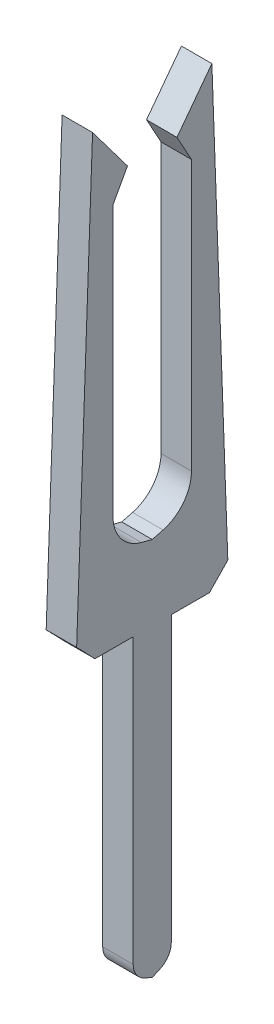
ISO-10303-21;
HEADER;
FILE_DESCRIPTION(('STEP AP214'),'2;1');
FILE_NAME('part.step','',(''),(''),'','','');
FILE_SCHEMA(('AUTOMOTIVE_DESIGN { 1 0 10303 214 1 1 1 1 }'));
ENDSEC;
DATA;
#1=APPLICATION_CONTEXT('core data for automotive mechanical design processes');
#2=APPLICATION_PROTOCOL_DEFINITION('international standard','automotive_design',2000,#1);
#3=PRODUCT_CONTEXT('',#1,'mechanical');
#4=PRODUCT('Part','Part','',(#3));
#5=PRODUCT_RELATED_PRODUCT_CATEGORY('part','',(#4));
#6=PRODUCT_DEFINITION_FORMATION('','',#4);
#7=PRODUCT_DEFINITION_CONTEXT('part definition',#1,'design');
#8=PRODUCT_DEFINITION('design','',#6,#7);
#9=PRODUCT_DEFINITION_SHAPE('','',#8);
#10=(LENGTH_UNIT() NAMED_UNIT(*) SI_UNIT(.MILLI.,.METRE.));
#11=(NAMED_UNIT(*) PLANE_ANGLE_UNIT() SI_UNIT($,.RADIAN.));
#12=(NAMED_UNIT(*) SI_UNIT($,.STERADIAN.) SOLID_ANGLE_UNIT());
#13=UNCERTAINTY_MEASURE_WITH_UNIT(LENGTH_MEASURE(1.E-05),#10,'distance_accuracy_value','');
#14=(GEOMETRIC_REPRESENTATION_CONTEXT(3) GLOBAL_UNCERTAINTY_ASSIGNED_CONTEXT((#13)) GLOBAL_UNIT_ASSIGNED_CONTEXT((#10,
#11,#12)) REPRESENTATION_CONTEXT('',''));
#15=CARTESIAN_POINT('',(0.,0.,0.));
#16=DIRECTION('',(0.,0.,1.));
#17=DIRECTION('',(1.,0.,0.));
#18=AXIS2_PLACEMENT_3D('',#15,#16,#17);
#19=CARTESIAN_POINT('',(0.4,2.15627423693323,0.277438328452502));
#20=DIRECTION('',(0.,0.694137309805425,0.71984261831048));
#21=DIRECTION('',(0.,-0.71984261831048,0.694137309805425));
#22=AXIS2_PLACEMENT_3D('',#19,#20,#21);
#23=PLANE('',#22);
#24=DIRECTION('',(0.,0.71984261831048,-0.694137309805425));
#25=VECTOR('',#24,1.);
#26=CARTESIAN_POINT('',(0.,2.15627423693323,0.277438328452502));
#27=LINE('',#26,#25);
#28=CARTESIAN_POINT('',(0.,1.90643942765456,0.518351630884458));
#29=VERTEX_POINT('',#28);
#30=CARTESIAN_POINT('',(0.,2.15627423693323,0.277438328452502));
#31=VERTEX_POINT('',#30);
#32=EDGE_CURVE('E214',#29,#31,#27,.T.);
#33=ORIENTED_EDGE('',*,*,#32,.T.);
#34=DIRECTION('',(-1.,0.,0.));
#35=VECTOR('',#34,1.);
#36=CARTESIAN_POINT('',(0.4,2.15627423693323,0.277438328452502));
#37=LINE('',#36,#35);
#38=CARTESIAN_POINT('',(0.4,2.15627423693323,0.277438328452502));
#39=VERTEX_POINT('',#38);
#40=EDGE_CURVE('E11',#39,#31,#37,.T.);
#41=ORIENTED_EDGE('',*,*,#40,.F.);
#42=DIRECTION('',(0.,0.71984261831048,-0.694137309805425));
#43=VECTOR('',#42,1.);
#44=CARTESIAN_POINT('',(0.4,2.15627423693323,0.277438328452502));
#45=LINE('',#44,#43);
#46=CARTESIAN_POINT('',(0.4,1.90643942765456,0.518351630884458));
#47=VERTEX_POINT('',#46);
#48=EDGE_CURVE('E256',#47,#39,#45,.T.);
#49=ORIENTED_EDGE('',*,*,#48,.F.);
#50=DIRECTION('',(-1.,0.,0.));
#51=VECTOR('',#50,1.);
#52=CARTESIAN_POINT('',(0.4,1.90643942765456,0.518351630884458));
#53=LINE('',#52,#51);
#54=EDGE_CURVE('E210',#47,#29,#53,.T.);
#55=ORIENTED_EDGE('',*,*,#54,.T.);
#56=EDGE_LOOP('',(#33,#41,#49,#55));
#57=FACE_BOUND('',#56,.T.);
#58=ADVANCED_FACE('F34',(#57),#23,.F.);
#59=CARTESIAN_POINT('',(0.4,7.90643942765456,0.486576567456251));
#60=DIRECTION('',(0.,-0.036346790272175,0.99933923711466));
#61=DIRECTION('',(0.,-0.99933923711466,-0.036346790272175));
#62=AXIS2_PLACEMENT_3D('',#59,#60,#61);
#63=PLANE('',#62);
#64=DIRECTION('',(0.,0.99933923711466,0.036346790272175));
#65=VECTOR('',#64,1.);
#66=CARTESIAN_POINT('',(0.,7.90643942765456,0.486576567456251));
#67=LINE('',#66,#65);
#68=CARTESIAN_POINT('',(0.,7.90643942765456,0.486576567456251));
#69=VERTEX_POINT('',#68);
#70=EDGE_CURVE('E217',#31,#69,#67,.T.);
#71=ORIENTED_EDGE('',*,*,#70,.T.);
#72=DIRECTION('',(-1.,0.,0.));
#73=VECTOR('',#72,1.);
#74=CARTESIAN_POINT('',(0.4,7.90643942765456,0.486576567456251));
#75=LINE('',#74,#73);
#76=CARTESIAN_POINT('',(0.4,7.90643942765456,0.486576567456251));
#77=VERTEX_POINT('',#76);
#78=EDGE_CURVE('E42',#77,#69,#75,.T.);
#79=ORIENTED_EDGE('',*,*,#78,.F.);
#80=DIRECTION('',(0.,0.99933923711466,0.036346790272175));
#81=VECTOR('',#80,1.);
#82=CARTESIAN_POINT('',(0.4,7.90643942765456,0.486576567456251));
#83=LINE('',#82,#81);
#84=EDGE_CURVE('E135',#39,#77,#83,.T.);
#85=ORIENTED_EDGE('',*,*,#84,.F.);
#86=ORIENTED_EDGE('',*,*,#40,.T.);
#87=EDGE_LOOP('',(#71,#79,#85,#86));
#88=FACE_BOUND('',#87,.T.);
#89=ADVANCED_FACE('F384',(#88),#63,.F.);
#90=CARTESIAN_POINT('',(0.4,7.29691604158744,0.944947879463951));
#91=DIRECTION('',(0.,-0.601030672473663,-0.799225957252301));
#92=DIRECTION('',(0.,0.799225957252301,-0.601030672473663));
#93=AXIS2_PLACEMENT_3D('',#90,#91,#92);
#94=PLANE('',#93);
#95=DIRECTION('',(0.,-0.799225957252301,0.601030672473663));
#96=VECTOR('',#95,1.);
#97=CARTESIAN_POINT('',(0.,7.29691604158744,0.944947879463951));
#98=LINE('',#97,#96);
#99=CARTESIAN_POINT('',(0.,7.29691604158744,0.944947879463951));
#100=VERTEX_POINT('',#99);
#101=EDGE_CURVE('E219',#69,#100,#98,.T.);
#102=ORIENTED_EDGE('',*,*,#101,.T.);
#103=DIRECTION('',(-1.,0.,0.));
#104=VECTOR('',#103,1.);
#105=CARTESIAN_POINT('',(0.4,7.29691604158744,0.944947879463951));
#106=LINE('',#105,#104);
#107=CARTESIAN_POINT('',(0.4,7.29691604158744,0.944947879463951));
#108=VERTEX_POINT('',#107);
#109=EDGE_CURVE('E305',#108,#100,#106,.T.);
#110=ORIENTED_EDGE('',*,*,#109,.F.);
#111=DIRECTION('',(0.,-0.799225957252301,0.601030672473663));
#112=VECTOR('',#111,1.);
#113=CARTESIAN_POINT('',(0.4,7.29691604158744,0.944947879463951));
#114=LINE('',#113,#112);
#115=EDGE_CURVE('E313',#77,#108,#114,.T.);
#116=ORIENTED_EDGE('',*,*,#115,.F.);
#117=ORIENTED_EDGE('',*,*,#78,.T.);
#118=EDGE_LOOP('',(#102,#110,#116,#117));
#119=FACE_BOUND('',#118,.T.);
#120=ADVANCED_FACE('F311',(#119),#94,.F.);
#121=CARTESIAN_POINT('',(0.4,6.95011825296304,0.754777343997982));
#122=DIRECTION('',(0.,0.480815317239039,-0.876821892238283));
#123=DIRECTION('',(0.,0.876821892238283,0.480815317239039));
#124=AXIS2_PLACEMENT_3D('',#121,#122,#123);
#125=PLANE('',#124);
#126=DIRECTION('',(0.,-0.876821892238283,-0.480815317239039));
#127=VECTOR('',#126,1.);
#128=CARTESIAN_POINT('',(0.,6.95011825296304,0.754777343997982));
#129=LINE('',#128,#127);
#130=CARTESIAN_POINT('',(0.,6.95011825296304,0.754777343997982));
#131=VERTEX_POINT('',#130);
#132=EDGE_CURVE('E221',#100,#131,#129,.T.);
#133=ORIENTED_EDGE('',*,*,#132,.T.);
#134=DIRECTION('',(-1.,0.,0.));
#135=VECTOR('',#134,1.);
#136=CARTESIAN_POINT('',(0.4,6.95011825296304,0.754777343997982));
#137=LINE('',#136,#135);
#138=CARTESIAN_POINT('',(0.4,6.95011825296304,0.754777343997982));
#139=VERTEX_POINT('',#138);
#140=EDGE_CURVE('E302',#139,#131,#137,.T.);
#141=ORIENTED_EDGE('',*,*,#140,.F.);
#142=DIRECTION('',(0.,-0.876821892238283,-0.480815317239039));
#143=VECTOR('',#142,1.);
#144=CARTESIAN_POINT('',(0.4,6.95011825296304,0.754777343997982));
#145=LINE('',#144,#143);
#146=EDGE_CURVE('E331',#108,#139,#145,.T.);
#147=ORIENTED_EDGE('',*,*,#146,.F.);
#148=ORIENTED_EDGE('',*,*,#109,.T.);
#149=EDGE_LOOP('',(#133,#141,#147,#148));
#150=FACE_BOUND('',#149,.T.);
#151=ADVANCED_FACE('F322',(#150),#125,.F.);
#152=CARTESIAN_POINT('',(0.4,3.40759606010662,0.754710604299908));
#153=DIRECTION('',(0.,1.88395991410638E-05,-0.999999999822535));
#154=DIRECTION('',(0.,0.999999999822535,1.88395991410638E-05));
#155=AXIS2_PLACEMENT_3D('',#152,#153,#154);
#156=PLANE('',#155);
#157=DIRECTION('',(0.,-0.999999999822535,-1.88395991410638E-05));
#158=VECTOR('',#157,1.);
#159=CARTESIAN_POINT('',(0.,3.40759606010662,0.754710604299908));
#160=LINE('',#159,#158);
#161=CARTESIAN_POINT('',(0.,3.40759606010662,0.754710604299908));
#162=VERTEX_POINT('',#161);
#163=EDGE_CURVE('E223',#131,#162,#160,.T.);
#164=ORIENTED_EDGE('',*,*,#163,.T.);
#165=DIRECTION('',(-1.,0.,0.));
#166=VECTOR('',#165,1.);
#167=CARTESIAN_POINT('',(0.4,3.40759606010662,0.754710604299908));
#168=LINE('',#167,#166);
#169=CARTESIAN_POINT('',(0.4,3.40759606010662,0.754710604299908));
#170=VERTEX_POINT('',#169);
#171=EDGE_CURVE('E299',#170,#162,#168,.T.);
#172=ORIENTED_EDGE('',*,*,#171,.F.);
#173=DIRECTION('',(0.,-0.999999999822535,-1.88395991410638E-05));
#174=VECTOR('',#173,1.);
#175=CARTESIAN_POINT('',(0.4,3.40759606010662,0.754710604299908));
#176=LINE('',#175,#174);
#177=EDGE_CURVE('E328',#139,#170,#176,.T.);
#178=ORIENTED_EDGE('',*,*,#177,.F.);
#179=ORIENTED_EDGE('',*,*,#140,.T.);
#180=EDGE_LOOP('',(#164,#172,#178,#179));
#181=FACE_BOUND('',#180,.T.);
#182=ADVANCED_FACE('F326',(#181),#156,.F.);
#183=CARTESIAN_POINT('',(0.4,3.40758664030705,1.25471060421118));
#184=DIRECTION('',(-1.,0.,0.));
#185=DIRECTION('',(0.,0.,1.));
#186=AXIS2_PLACEMENT_3D('',#183,#184,#185);
#187=CYLINDRICAL_SURFACE('',#186,0.5);
#188=CARTESIAN_POINT('',(0.,3.40758664030705,1.25471060421118));
#189=DIRECTION('',(-1.,0.,0.));
#190=DIRECTION('',(0.,0.,-1.));
#191=AXIS2_PLACEMENT_3D('',#188,#189,#190);
#192=CIRCLE('',#191,0.5);
#193=CARTESIAN_POINT('',(0.,2.92391221511593,1.127986295509));
#194=VERTEX_POINT('',#193);
#195=EDGE_CURVE('E225',#162,#194,#192,.T.);
#196=ORIENTED_EDGE('',*,*,#195,.T.);
#197=DIRECTION('',(-1.,0.,0.));
#198=VECTOR('',#197,1.);
#199=CARTESIAN_POINT('',(0.4,2.92391221511593,1.127986295509));
#200=LINE('',#199,#198);
#201=CARTESIAN_POINT('',(0.4,2.92391221511593,1.127986295509));
#202=VERTEX_POINT('',#201);
#203=EDGE_CURVE('E296',#202,#194,#200,.T.);
#204=ORIENTED_EDGE('',*,*,#203,.F.);
#205=CARTESIAN_POINT('',(0.4,3.40758664030705,1.25471060421118));
#206=DIRECTION('',(-1.,0.,0.));
#207=DIRECTION('',(0.,0.,-1.));
#208=AXIS2_PLACEMENT_3D('',#205,#206,#207);
#209=CIRCLE('',#208,0.5);
#210=EDGE_CURVE('E330',#170,#202,#209,.T.);
#211=ORIENTED_EDGE('',*,*,#210,.F.);
#212=ORIENTED_EDGE('',*,*,#171,.T.);
#213=EDGE_LOOP('',(#196,#204,#211,#212));
#214=FACE_BOUND('',#213,.T.);
#215=ADVANCED_FACE('F397',(#214),#187,.F.);
#216=CARTESIAN_POINT('',(0.4,2.88671780777912,1.26994787946395));
#217=DIRECTION('',(0.,-0.967348850382229,-0.253448617404358));
#218=DIRECTION('',(0.,0.253448617404358,-0.967348850382229));
#219=AXIS2_PLACEMENT_3D('',#216,#217,#218);
#220=PLANE('',#219);
#221=DIRECTION('',(0.,-0.253448617404358,0.967348850382229));
#222=VECTOR('',#221,1.);
#223=CARTESIAN_POINT('',(0.,2.88671780777912,1.26994787946395));
#224=LINE('',#223,#222);
#225=CARTESIAN_POINT('',(0.,2.88671780777912,1.26994787946395));
#226=VERTEX_POINT('',#225);
#227=EDGE_CURVE('E227',#194,#226,#224,.T.);
#228=ORIENTED_EDGE('',*,*,#227,.T.);
#229=DIRECTION('',(-1.,0.,0.));
#230=VECTOR('',#229,1.);
#231=CARTESIAN_POINT('',(0.4,2.88671780777912,1.26994787946395));
#232=LINE('',#231,#230);
#233=CARTESIAN_POINT('',(0.4,2.88671780777912,1.26994787946395));
#234=VERTEX_POINT('',#233);
#235=EDGE_CURVE('E293',#234,#226,#232,.T.);
#236=ORIENTED_EDGE('',*,*,#235,.F.);
#237=DIRECTION('',(0.,-0.253448617404358,0.967348850382229));
#238=VECTOR('',#237,1.);
#239=CARTESIAN_POINT('',(0.4,2.88671780777912,1.26994787946395));
#240=LINE('',#239,#238);
#241=EDGE_CURVE('E333',#202,#234,#240,.T.);
#242=ORIENTED_EDGE('',*,*,#241,.F.);
#243=ORIENTED_EDGE('',*,*,#203,.T.);
#244=EDGE_LOOP('',(#228,#236,#242,#243));
#245=FACE_BOUND('',#244,.T.);
#246=ADVANCED_FACE('F400',(#245),#220,.F.);
#247=CARTESIAN_POINT('',(0.4,2.88671780777912,1.26994787946395));
#248=DIRECTION('',(0.,-0.967348850382229,0.253448617404358));
#249=DIRECTION('',(0.,-0.253448617404358,-0.967348850382229));
#250=AXIS2_PLACEMENT_3D('',#247,#248,#249);
#251=PLANE('',#250);
#252=DIRECTION('',(0.,0.253448617404358,0.967348850382229));
#253=VECTOR('',#252,1.);
#254=CARTESIAN_POINT('',(0.,2.88671780777912,1.26994787946395));
#255=LINE('',#254,#253);
#256=CARTESIAN_POINT('',(0.,2.92391221511593,1.4119094634189));
#257=VERTEX_POINT('',#256);
#258=EDGE_CURVE('E229',#226,#257,#255,.T.);
#259=ORIENTED_EDGE('',*,*,#258,.T.);
#260=DIRECTION('',(-1.,0.,0.));
#261=VECTOR('',#260,1.);
#262=CARTESIAN_POINT('',(0.4,2.92391221511593,1.4119094634189));
#263=LINE('',#262,#261);
#264=CARTESIAN_POINT('',(0.4,2.92391221511593,1.4119094634189));
#265=VERTEX_POINT('',#264);
#266=EDGE_CURVE('E290',#265,#257,#263,.T.);
#267=ORIENTED_EDGE('',*,*,#266,.F.);
#268=DIRECTION('',(0.,0.253448617404358,0.967348850382229));
#269=VECTOR('',#268,1.);
#270=CARTESIAN_POINT('',(0.4,2.88671780777912,1.26994787946395));
#271=LINE('',#270,#269);
#272=EDGE_CURVE('E339',#234,#265,#271,.T.);
#273=ORIENTED_EDGE('',*,*,#272,.F.);
#274=ORIENTED_EDGE('',*,*,#235,.T.);
#275=EDGE_LOOP('',(#259,#267,#273,#274));
#276=FACE_BOUND('',#275,.T.);
#277=ADVANCED_FACE('F404',(#276),#251,.F.);
#278=CARTESIAN_POINT('',(0.4,3.40758664030705,1.28518515471672));
#279=DIRECTION('',(-1.,0.,0.));
#280=DIRECTION('',(0.,0.,1.));
#281=AXIS2_PLACEMENT_3D('',#278,#279,#280);
#282=CYLINDRICAL_SURFACE('',#281,0.5);
#283=CARTESIAN_POINT('',(0.,3.40758664030705,1.28518515471672));
#284=DIRECTION('',(-1.,0.,0.));
#285=DIRECTION('',(0.,0.,1.));
#286=AXIS2_PLACEMENT_3D('',#283,#284,#285);
#287=CIRCLE('',#286,0.5);
#288=CARTESIAN_POINT('',(0.,3.40759606010662,1.78518515462799));
#289=VERTEX_POINT('',#288);
#290=EDGE_CURVE('E231',#257,#289,#287,.T.);
#291=ORIENTED_EDGE('',*,*,#290,.T.);
#292=DIRECTION('',(-1.,0.,0.));
#293=VECTOR('',#292,1.);
#294=CARTESIAN_POINT('',(0.4,3.40759606010662,1.78518515462799));
#295=LINE('',#294,#293);
#296=CARTESIAN_POINT('',(0.4,3.40759606010662,1.78518515462799));
#297=VERTEX_POINT('',#296);
#298=EDGE_CURVE('E287',#297,#289,#295,.T.);
#299=ORIENTED_EDGE('',*,*,#298,.F.);
#300=CARTESIAN_POINT('',(0.4,3.40758664030705,1.28518515471672));
#301=DIRECTION('',(-1.,0.,0.));
#302=DIRECTION('',(0.,0.,1.));
#303=AXIS2_PLACEMENT_3D('',#300,#301,#302);
#304=CIRCLE('',#303,0.5);
#305=EDGE_CURVE('E341',#265,#297,#304,.T.);
#306=ORIENTED_EDGE('',*,*,#305,.F.);
#307=ORIENTED_EDGE('',*,*,#266,.T.);
#308=EDGE_LOOP('',(#291,#299,#306,#307));
#309=FACE_BOUND('',#308,.T.);
#310=ADVANCED_FACE('F408',(#309),#282,.F.);
#311=CARTESIAN_POINT('',(0.4,3.40759606010662,1.78518515462799));
#312=DIRECTION('',(0.,1.88395991408802E-05,0.999999999822535));
#313=DIRECTION('',(0.,-0.999999999822535,1.88395991408802E-05));
#314=AXIS2_PLACEMENT_3D('',#311,#312,#313);
#315=PLANE('',#314);
#316=DIRECTION('',(0.,0.999999999822535,-1.88395991408802E-05));
#317=VECTOR('',#316,1.);
#318=CARTESIAN_POINT('',(0.,3.40759606010662,1.78518515462799));
#319=LINE('',#318,#317);
#320=CARTESIAN_POINT('',(0.,6.95011825296304,1.78511841492992));
#321=VERTEX_POINT('',#320);
#322=EDGE_CURVE('E233',#289,#321,#319,.T.);
#323=ORIENTED_EDGE('',*,*,#322,.T.);
#324=DIRECTION('',(-1.,0.,0.));
#325=VECTOR('',#324,1.);
#326=CARTESIAN_POINT('',(0.4,6.95011825296304,1.78511841492992));
#327=LINE('',#326,#325);
#328=CARTESIAN_POINT('',(0.4,6.95011825296304,1.78511841492992));
#329=VERTEX_POINT('',#328);
#330=EDGE_CURVE('E284',#329,#321,#327,.T.);
#331=ORIENTED_EDGE('',*,*,#330,.F.);
#332=DIRECTION('',(0.,0.999999999822535,-1.88395991408802E-05));
#333=VECTOR('',#332,1.);
#334=CARTESIAN_POINT('',(0.4,3.40759606010662,1.78518515462799));
#335=LINE('',#334,#333);
#336=EDGE_CURVE('E343',#297,#329,#335,.T.);
#337=ORIENTED_EDGE('',*,*,#336,.F.);
#338=ORIENTED_EDGE('',*,*,#298,.T.);
#339=EDGE_LOOP('',(#323,#331,#337,#338));
#340=FACE_BOUND('',#339,.T.);
#341=ADVANCED_FACE('F412',(#340),#315,.F.);
#342=CARTESIAN_POINT('',(0.4,6.95011825296304,1.78511841492992));
#343=DIRECTION('',(0.,0.480815317239038,0.876821892238283));
#344=DIRECTION('',(0.,-0.876821892238283,0.480815317239038));
#345=AXIS2_PLACEMENT_3D('',#342,#343,#344);
#346=PLANE('',#345);
#347=DIRECTION('',(0.,0.876821892238283,-0.480815317239038));
#348=VECTOR('',#347,1.);
#349=CARTESIAN_POINT('',(0.,6.95011825296304,1.78511841492992));
#350=LINE('',#349,#348);
#351=CARTESIAN_POINT('',(0.,7.29691604158744,1.59494787946395));
#352=VERTEX_POINT('',#351);
#353=EDGE_CURVE('E235',#321,#352,#350,.T.);
#354=ORIENTED_EDGE('',*,*,#353,.T.);
#355=DIRECTION('',(-1.,0.,0.));
#356=VECTOR('',#355,1.);
#357=CARTESIAN_POINT('',(0.4,7.29691604158744,1.59494787946395));
#358=LINE('',#357,#356);
#359=CARTESIAN_POINT('',(0.4,7.29691604158744,1.59494787946395));
#360=VERTEX_POINT('',#359);
#361=EDGE_CURVE('E281',#360,#352,#358,.T.);
#362=ORIENTED_EDGE('',*,*,#361,.F.);
#363=DIRECTION('',(0.,0.876821892238283,-0.480815317239038));
#364=VECTOR('',#363,1.);
#365=CARTESIAN_POINT('',(0.4,6.95011825296304,1.78511841492992));
#366=LINE('',#365,#364);
#367=EDGE_CURVE('E345',#329,#360,#366,.T.);
#368=ORIENTED_EDGE('',*,*,#367,.F.);
#369=ORIENTED_EDGE('',*,*,#330,.T.);
#370=EDGE_LOOP('',(#354,#362,#368,#369));
#371=FACE_BOUND('',#370,.T.);
#372=ADVANCED_FACE('F416',(#371),#346,.F.);
#373=CARTESIAN_POINT('',(0.4,7.29691604158744,1.59494787946395));
#374=DIRECTION('',(0.,-0.601030672473662,0.799225957252301));
#375=DIRECTION('',(0.,-0.799225957252301,-0.601030672473662));
#376=AXIS2_PLACEMENT_3D('',#373,#374,#375);
#377=PLANE('',#376);
#378=DIRECTION('',(0.,0.799225957252301,0.601030672473662));
#379=VECTOR('',#378,1.);
#380=CARTESIAN_POINT('',(0.,7.29691604158744,1.59494787946395));
#381=LINE('',#380,#379);
#382=CARTESIAN_POINT('',(0.,7.90643942765456,2.05331919147165));
#383=VERTEX_POINT('',#382);
#384=EDGE_CURVE('E237',#352,#383,#381,.T.);
#385=ORIENTED_EDGE('',*,*,#384,.T.);
#386=DIRECTION('',(-1.,0.,0.));
#387=VECTOR('',#386,1.);
#388=CARTESIAN_POINT('',(0.4,7.90643942765456,2.05331919147165));
#389=LINE('',#388,#387);
#390=CARTESIAN_POINT('',(0.4,7.90643942765456,2.05331919147165));
#391=VERTEX_POINT('',#390);
#392=EDGE_CURVE('E278',#391,#383,#389,.T.);
#393=ORIENTED_EDGE('',*,*,#392,.F.);
#394=DIRECTION('',(0.,0.799225957252301,0.601030672473662));
#395=VECTOR('',#394,1.);
#396=CARTESIAN_POINT('',(0.4,7.29691604158744,1.59494787946395));
#397=LINE('',#396,#395);
#398=EDGE_CURVE('E347',#360,#391,#397,.T.);
#399=ORIENTED_EDGE('',*,*,#398,.F.);
#400=ORIENTED_EDGE('',*,*,#361,.T.);
#401=EDGE_LOOP('',(#385,#393,#399,#400));
#402=FACE_BOUND('',#401,.T.);
#403=ADVANCED_FACE('F420',(#402),#377,.F.);
#404=CARTESIAN_POINT('',(0.4,7.90643942765456,2.05331919147165));
#405=DIRECTION('',(0.,-0.0363467902721749,-0.99933923711466));
#406=DIRECTION('',(0.,0.99933923711466,-0.0363467902721749));
#407=AXIS2_PLACEMENT_3D('',#404,#405,#406);
#408=PLANE('',#407);
#409=DIRECTION('',(0.,-0.99933923711466,0.0363467902721749));
#410=VECTOR('',#409,1.);
#411=CARTESIAN_POINT('',(0.,7.90643942765456,2.05331919147165));
#412=LINE('',#411,#410);
#413=CARTESIAN_POINT('',(0.,2.15627423693323,2.26245743047539));
#414=VERTEX_POINT('',#413);
#415=EDGE_CURVE('E239',#383,#414,#412,.T.);
#416=ORIENTED_EDGE('',*,*,#415,.T.);
#417=DIRECTION('',(-1.,0.,0.));
#418=VECTOR('',#417,1.);
#419=CARTESIAN_POINT('',(0.4,2.15627423693323,2.26245743047539));
#420=LINE('',#419,#418);
#421=CARTESIAN_POINT('',(0.4,2.15627423693323,2.26245743047539));
#422=VERTEX_POINT('',#421);
#423=EDGE_CURVE('E275',#422,#414,#420,.T.);
#424=ORIENTED_EDGE('',*,*,#423,.F.);
#425=DIRECTION('',(0.,-0.99933923711466,0.0363467902721749));
#426=VECTOR('',#425,1.);
#427=CARTESIAN_POINT('',(0.4,7.90643942765456,2.05331919147165));
#428=LINE('',#427,#426);
#429=EDGE_CURVE('E349',#391,#422,#428,.T.);
#430=ORIENTED_EDGE('',*,*,#429,.F.);
#431=ORIENTED_EDGE('',*,*,#392,.T.);
#432=EDGE_LOOP('',(#416,#424,#430,#431));
#433=FACE_BOUND('',#432,.T.);
#434=ADVANCED_FACE('F424',(#433),#408,.F.);
#435=CARTESIAN_POINT('',(0.4,2.15627423693323,2.26245743047539));
#436=DIRECTION('',(0.,0.694137309805425,-0.71984261831048));
#437=DIRECTION('',(0.,0.71984261831048,0.694137309805426));
#438=AXIS2_PLACEMENT_3D('',#435,#436,#437);
#439=PLANE('',#438);
#440=DIRECTION('',(0.,-0.71984261831048,-0.694137309805426));
#441=VECTOR('',#440,1.);
#442=CARTESIAN_POINT('',(0.,2.15627423693323,2.26245743047539));
#443=LINE('',#442,#441);
#444=CARTESIAN_POINT('',(0.,1.90643942765456,2.02154412804344));
#445=VERTEX_POINT('',#444);
#446=EDGE_CURVE('E241',#414,#445,#443,.T.);
#447=ORIENTED_EDGE('',*,*,#446,.T.);
#448=DIRECTION('',(-1.,0.,0.));
#449=VECTOR('',#448,1.);
#450=CARTESIAN_POINT('',(0.4,1.90643942765456,2.02154412804344));
#451=LINE('',#450,#449);
#452=CARTESIAN_POINT('',(0.4,1.90643942765456,2.02154412804344));
#453=VERTEX_POINT('',#452);
#454=EDGE_CURVE('E272',#453,#445,#451,.T.);
#455=ORIENTED_EDGE('',*,*,#454,.F.);
#456=DIRECTION('',(0.,-0.71984261831048,-0.694137309805426));
#457=VECTOR('',#456,1.);
#458=CARTESIAN_POINT('',(0.4,2.15627423693323,2.26245743047539));
#459=LINE('',#458,#457);
#460=EDGE_CURVE('E351',#422,#453,#459,.T.);
#461=ORIENTED_EDGE('',*,*,#460,.F.);
#462=ORIENTED_EDGE('',*,*,#423,.T.);
#463=EDGE_LOOP('',(#447,#455,#461,#462));
#464=FACE_BOUND('',#463,.T.);
#465=ADVANCED_FACE('F428',(#464),#439,.F.);
#466=CARTESIAN_POINT('',(0.4,1.90643942765456,2.02154412804344));
#467=DIRECTION('',(0.,1.,0.));
#468=DIRECTION('',(0.,0.,1.));
#469=AXIS2_PLACEMENT_3D('',#466,#467,#468);
#470=PLANE('',#469);
#471=DIRECTION('',(0.,0.,-1.));
#472=VECTOR('',#471,1.);
#473=CARTESIAN_POINT('',(0.,1.90643942765456,2.02154412804344));
#474=LINE('',#473,#472);
#475=CARTESIAN_POINT('',(0.,1.90643942765456,1.51994787946395));
#476=VERTEX_POINT('',#475);
#477=EDGE_CURVE('E243',#445,#476,#474,.T.);
#478=ORIENTED_EDGE('',*,*,#477,.T.);
#479=DIRECTION('',(-1.,0.,0.));
#480=VECTOR('',#479,1.);
#481=CARTESIAN_POINT('',(0.4,1.90643942765456,1.51994787946395));
#482=LINE('',#481,#480);
#483=CARTESIAN_POINT('',(0.4,1.90643942765456,1.51994787946395));
#484=VERTEX_POINT('',#483);
#485=EDGE_CURVE('E269',#484,#476,#482,.T.);
#486=ORIENTED_EDGE('',*,*,#485,.F.);
#487=DIRECTION('',(0.,0.,-1.));
#488=VECTOR('',#487,1.);
#489=CARTESIAN_POINT('',(0.4,1.90643942765456,2.02154412804344));
#490=LINE('',#489,#488);
#491=EDGE_CURVE('E353',#453,#484,#490,.T.);
#492=ORIENTED_EDGE('',*,*,#491,.F.);
#493=ORIENTED_EDGE('',*,*,#454,.T.);
#494=EDGE_LOOP('',(#478,#486,#492,#493));
#495=FACE_BOUND('',#494,.T.);
#496=ADVANCED_FACE('F432',(#495),#470,.F.);
#497=CARTESIAN_POINT('',(0.4,1.90643942765456,1.51994787946395));
#498=DIRECTION('',(0.,0.,-1.));
#499=DIRECTION('',(0.,1.,0.));
#500=AXIS2_PLACEMENT_3D('',#497,#498,#499);
#501=PLANE('',#500);
#502=DIRECTION('',(0.,-1.,0.));
#503=VECTOR('',#502,1.);
#504=CARTESIAN_POINT('',(0.,1.90643942765456,1.51994787946395));
#505=LINE('',#504,#503);
#506=CARTESIAN_POINT('',(0.,-1.82003778744792,1.51994787946395));
#507=VERTEX_POINT('',#506);
#508=EDGE_CURVE('E245',#476,#507,#505,.T.);
#509=ORIENTED_EDGE('',*,*,#508,.T.);
#510=DIRECTION('',(-1.,0.,0.));
#511=VECTOR('',#510,1.);
#512=CARTESIAN_POINT('',(0.4,-1.82003778744792,1.51994787946395));
#513=LINE('',#512,#511);
#514=CARTESIAN_POINT('',(0.4,-1.82003778744792,1.51994787946395));
#515=VERTEX_POINT('',#514);
#516=EDGE_CURVE('E266',#515,#507,#513,.T.);
#517=ORIENTED_EDGE('',*,*,#516,.F.);
#518=DIRECTION('',(0.,-1.,0.));
#519=VECTOR('',#518,1.);
#520=CARTESIAN_POINT('',(0.4,1.90643942765456,1.51994787946395));
#521=LINE('',#520,#519);
#522=EDGE_CURVE('E355',#484,#515,#521,.T.);
#523=ORIENTED_EDGE('',*,*,#522,.F.);
#524=ORIENTED_EDGE('',*,*,#485,.T.);
#525=EDGE_LOOP('',(#509,#517,#523,#524));
#526=FACE_BOUND('',#525,.T.);
#527=ADVANCED_FACE('F436',(#526),#501,.F.);
#528=CARTESIAN_POINT('',(0.4,-1.82003778744792,1.26994787946395));
#529=DIRECTION('',(-1.,0.,0.));
#530=DIRECTION('',(0.,0.,1.));
#531=AXIS2_PLACEMENT_3D('',#528,#529,#530);
#532=CYLINDRICAL_SURFACE('',#531,0.249999999999999);
#533=CARTESIAN_POINT('',(0.,-1.82003778744792,1.26994787946395));
#534=DIRECTION('',(1.,0.,0.));
#535=DIRECTION('',(0.,0.,-1.));
#536=AXIS2_PLACEMENT_3D('',#533,#534,#535);
#537=CIRCLE('',#536,0.249999999999999);
#538=CARTESIAN_POINT('',(0.,-2.04853794703578,1.37137606621853));
#539=VERTEX_POINT('',#538);
#540=EDGE_CURVE('E247',#507,#539,#537,.T.);
#541=ORIENTED_EDGE('',*,*,#540,.T.);
#542=DIRECTION('',(-1.,0.,0.));
#543=VECTOR('',#542,1.);
#544=CARTESIAN_POINT('',(0.4,-2.04853794703578,1.37137606621853));
#545=LINE('',#544,#543);
#546=CARTESIAN_POINT('',(0.4,-2.04853794703578,1.37137606621853));
#547=VERTEX_POINT('',#546);
#548=EDGE_CURVE('E263',#547,#539,#545,.T.);
#549=ORIENTED_EDGE('',*,*,#548,.F.);
#550=CARTESIAN_POINT('',(0.4,-1.82003778744792,1.26994787946395));
#551=DIRECTION('',(1.,0.,0.));
#552=DIRECTION('',(0.,0.,-1.));
#553=AXIS2_PLACEMENT_3D('',#550,#551,#552);
#554=CIRCLE('',#553,0.249999999999999);
#555=EDGE_CURVE('E357',#515,#547,#554,.T.);
#556=ORIENTED_EDGE('',*,*,#555,.F.);
#557=ORIENTED_EDGE('',*,*,#516,.T.);
#558=EDGE_LOOP('',(#541,#549,#556,#557));
#559=FACE_BOUND('',#558,.T.);
#560=ADVANCED_FACE('F440',(#559),#532,.T.);
#561=CARTESIAN_POINT('',(0.4,-2.04853794703578,1.37137606621853));
#562=DIRECTION('',(0.,0.914000638351446,-0.405712747018317));
#563=DIRECTION('',(0.,0.405712747018317,0.914000638351446));
#564=AXIS2_PLACEMENT_3D('',#561,#562,#563);
#565=PLANE('',#564);
#566=DIRECTION('',(0.,-0.405712747018317,-0.914000638351446));
#567=VECTOR('',#566,1.);
#568=CARTESIAN_POINT('',(0.,-2.04853794703578,1.37137606621853));
#569=LINE('',#568,#567);
#570=CARTESIAN_POINT('',(0.,-2.09356057234545,1.26994787946395));
#571=VERTEX_POINT('',#570);
#572=EDGE_CURVE('E249',#539,#571,#569,.T.);
#573=ORIENTED_EDGE('',*,*,#572,.T.);
#574=DIRECTION('',(-1.,0.,0.));
#575=VECTOR('',#574,1.);
#576=CARTESIAN_POINT('',(0.4,-2.09356057234545,1.26994787946395));
#577=LINE('',#576,#575);
#578=CARTESIAN_POINT('',(0.4,-2.09356057234545,1.26994787946395));
#579=VERTEX_POINT('',#578);
#580=EDGE_CURVE('E260',#579,#571,#577,.T.);
#581=ORIENTED_EDGE('',*,*,#580,.F.);
#582=DIRECTION('',(0.,-0.405712747018317,-0.914000638351446));
#583=VECTOR('',#582,1.);
#584=CARTESIAN_POINT('',(0.4,-2.04853794703578,1.37137606621853));
#585=LINE('',#584,#583);
#586=EDGE_CURVE('E359',#547,#579,#585,.T.);
#587=ORIENTED_EDGE('',*,*,#586,.F.);
#588=ORIENTED_EDGE('',*,*,#548,.T.);
#589=EDGE_LOOP('',(#573,#581,#587,#588));
#590=FACE_BOUND('',#589,.T.);
#591=ADVANCED_FACE('F365',(#590),#565,.F.);
#592=CARTESIAN_POINT('',(0.4,-2.04853794703579,1.16851969270938));
#593=DIRECTION('',(0.,0.914000638351438,0.405712747018336));
#594=DIRECTION('',(0.,-0.405712747018336,0.914000638351438));
#595=AXIS2_PLACEMENT_3D('',#592,#593,#594);
#596=PLANE('',#595);
#597=DIRECTION('',(0.,0.405712747018336,-0.914000638351438));
#598=VECTOR('',#597,1.);
#599=CARTESIAN_POINT('',(0.,-2.04853794703579,1.16851969270938));
#600=LINE('',#599,#598);
#601=CARTESIAN_POINT('',(0.,-2.04853794703579,1.16851969270938));
#602=VERTEX_POINT('',#601);
#603=EDGE_CURVE('E251',#571,#602,#600,.T.);
#604=ORIENTED_EDGE('',*,*,#603,.T.);
#605=DIRECTION('',(-1.,0.,0.));
#606=VECTOR('',#605,1.);
#607=CARTESIAN_POINT('',(0.4,-2.04853794703579,1.16851969270938));
#608=LINE('',#607,#606);
#609=CARTESIAN_POINT('',(0.4,-2.04853794703579,1.16851969270938));
#610=VERTEX_POINT('',#609);
#611=EDGE_CURVE('E205',#610,#602,#608,.T.);
#612=ORIENTED_EDGE('',*,*,#611,.F.);
#613=DIRECTION('',(0.,0.405712747018336,-0.914000638351438));
#614=VECTOR('',#613,1.);
#615=CARTESIAN_POINT('',(0.4,-2.04853794703579,1.16851969270938));
#616=LINE('',#615,#614);
#617=EDGE_CURVE('E196',#579,#610,#616,.T.);
#618=ORIENTED_EDGE('',*,*,#617,.F.);
#619=ORIENTED_EDGE('',*,*,#580,.T.);
#620=EDGE_LOOP('',(#604,#612,#618,#619));
#621=FACE_BOUND('',#620,.T.);
#622=ADVANCED_FACE('F369',(#621),#596,.F.);
#623=CARTESIAN_POINT('',(0.4,-1.82003778744792,1.26994787946395));
#624=DIRECTION('',(-1.,0.,0.));
#625=DIRECTION('',(0.,0.,1.));
#626=AXIS2_PLACEMENT_3D('',#623,#624,#625);
#627=CYLINDRICAL_SURFACE('',#626,0.25);
#628=CARTESIAN_POINT('',(0.,-1.82003778744792,1.26994787946395));
#629=DIRECTION('',(1.,0.,0.));
#630=DIRECTION('',(0.,0.,1.));
#631=AXIS2_PLACEMENT_3D('',#628,#629,#630);
#632=CIRCLE('',#631,0.25);
#633=CARTESIAN_POINT('',(0.,-1.82003778744792,1.01994787946395));
#634=VERTEX_POINT('',#633);
#635=EDGE_CURVE('E204',#602,#634,#632,.T.);
#636=ORIENTED_EDGE('',*,*,#635,.T.);
#637=DIRECTION('',(-1.,0.,0.));
#638=VECTOR('',#637,1.);
#639=CARTESIAN_POINT('',(0.4,-1.82003778744792,1.01994787946395));
#640=LINE('',#639,#638);
#641=CARTESIAN_POINT('',(0.4,-1.82003778744792,1.01994787946395));
#642=VERTEX_POINT('',#641);
#643=EDGE_CURVE('E201',#642,#634,#640,.T.);
#644=ORIENTED_EDGE('',*,*,#643,.F.);
#645=CARTESIAN_POINT('',(0.4,-1.82003778744792,1.26994787946395));
#646=DIRECTION('',(1.,0.,0.));
#647=DIRECTION('',(0.,0.,1.));
#648=AXIS2_PLACEMENT_3D('',#645,#646,#647);
#649=CIRCLE('',#648,0.25);
#650=EDGE_CURVE('E190',#610,#642,#649,.T.);
#651=ORIENTED_EDGE('',*,*,#650,.F.);
#652=ORIENTED_EDGE('',*,*,#611,.T.);
#653=EDGE_LOOP('',(#636,#644,#651,#652));
#654=FACE_BOUND('',#653,.T.);
#655=ADVANCED_FACE('F202',(#654),#627,.T.);
#656=CARTESIAN_POINT('',(0.4,1.90643942765456,1.01994787946395));
#657=DIRECTION('',(0.,0.,1.));
#658=DIRECTION('',(1.,0.,0.));
#659=AXIS2_PLACEMENT_3D('',#656,#657,#658);
#660=PLANE('',#659);
#661=DIRECTION('',(0.,1.,0.));
#662=VECTOR('',#661,1.);
#663=CARTESIAN_POINT('',(0.,1.90643942765456,1.01994787946395));
#664=LINE('',#663,#662);
#665=CARTESIAN_POINT('',(0.,1.90643942765456,1.01994787946395));
#666=VERTEX_POINT('',#665);
#667=EDGE_CURVE('E121',#634,#666,#664,.T.);
#668=ORIENTED_EDGE('',*,*,#667,.T.);
#669=DIRECTION('',(-1.,0.,0.));
#670=VECTOR('',#669,1.);
#671=CARTESIAN_POINT('',(0.4,1.90643942765456,1.01994787946395));
#672=LINE('',#671,#670);
#673=CARTESIAN_POINT('',(0.4,1.90643942765456,1.01994787946395));
#674=VERTEX_POINT('',#673);
#675=EDGE_CURVE('E206',#674,#666,#672,.T.);
#676=ORIENTED_EDGE('',*,*,#675,.F.);
#677=DIRECTION('',(0.,1.,0.));
#678=VECTOR('',#677,1.);
#679=CARTESIAN_POINT('',(0.4,1.90643942765456,1.01994787946395));
#680=LINE('',#679,#678);
#681=EDGE_CURVE('E194',#642,#674,#680,.T.);
#682=ORIENTED_EDGE('',*,*,#681,.F.);
#683=ORIENTED_EDGE('',*,*,#643,.T.);
#684=EDGE_LOOP('',(#668,#676,#682,#683));
#685=FACE_BOUND('',#684,.T.);
#686=ADVANCED_FACE('F208',(#685),#660,.F.);
#687=CARTESIAN_POINT('',(0.4,1.90643942765456,0.518351630884458));
#688=DIRECTION('',(0.,1.,0.));
#689=DIRECTION('',(0.,0.,1.));
#690=AXIS2_PLACEMENT_3D('',#687,#688,#689);
#691=PLANE('',#690);
#692=DIRECTION('',(0.,0.,-1.));
#693=VECTOR('',#692,1.);
#694=CARTESIAN_POINT('',(0.,1.90643942765456,0.518351630884458));
#695=LINE('',#694,#693);
#696=EDGE_CURVE('E127',#666,#29,#695,.T.);
#697=ORIENTED_EDGE('',*,*,#696,.T.);
#698=ORIENTED_EDGE('',*,*,#54,.F.);
#699=DIRECTION('',(0.,0.,-1.));
#700=VECTOR('',#699,1.);
#701=CARTESIAN_POINT('',(0.4,1.90643942765456,0.518351630884458));
#702=LINE('',#701,#700);
#703=EDGE_CURVE('E50',#674,#47,#702,.T.);
#704=ORIENTED_EDGE('',*,*,#703,.F.);
#705=ORIENTED_EDGE('',*,*,#675,.T.);
#706=EDGE_LOOP('',(#697,#698,#704,#705));
#707=FACE_BOUND('',#706,.T.);
#708=ADVANCED_FACE('F373',(#707),#691,.F.);
#709=CARTESIAN_POINT('',(0.4,-1.82003778744792,1.26994787946395));
#710=DIRECTION('',(-1.,0.,0.));
#711=DIRECTION('',(0.,0.,1.));
#712=AXIS2_PLACEMENT_3D('',#709,#710,#711);
#713=PLANE('',#712);
#714=ORIENTED_EDGE('',*,*,#48,.T.);
#715=ORIENTED_EDGE('',*,*,#84,.T.);
#716=ORIENTED_EDGE('',*,*,#115,.T.);
#717=ORIENTED_EDGE('',*,*,#146,.T.);
#718=ORIENTED_EDGE('',*,*,#177,.T.);
#719=ORIENTED_EDGE('',*,*,#210,.T.);
#720=ORIENTED_EDGE('',*,*,#241,.T.);
#721=ORIENTED_EDGE('',*,*,#272,.T.);
#722=ORIENTED_EDGE('',*,*,#305,.T.);
#723=ORIENTED_EDGE('',*,*,#336,.T.);
#724=ORIENTED_EDGE('',*,*,#367,.T.);
#725=ORIENTED_EDGE('',*,*,#398,.T.);
#726=ORIENTED_EDGE('',*,*,#429,.T.);
#727=ORIENTED_EDGE('',*,*,#460,.T.);
#728=ORIENTED_EDGE('',*,*,#491,.T.);
#729=ORIENTED_EDGE('',*,*,#522,.T.);
#730=ORIENTED_EDGE('',*,*,#555,.T.);
#731=ORIENTED_EDGE('',*,*,#586,.T.);
#732=ORIENTED_EDGE('',*,*,#617,.T.);
#733=ORIENTED_EDGE('',*,*,#650,.T.);
#734=ORIENTED_EDGE('',*,*,#681,.T.);
#735=ORIENTED_EDGE('',*,*,#703,.T.);
#736=EDGE_LOOP('',(#714,#715,#716,#717,#718,#719,#720,#721,#722,#723,#724,#725,#726,#727,#728,
#729,#730,#731,#732,#733,#734,#735));
#737=FACE_BOUND('',#736,.T.);
#738=ADVANCED_FACE('F192',(#737),#713,.F.);
#739=CARTESIAN_POINT('',(0.,-1.82003778744792,1.26994787946395));
#740=DIRECTION('',(-1.,0.,0.));
#741=DIRECTION('',(0.,0.,1.));
#742=AXIS2_PLACEMENT_3D('',#739,#740,#741);
#743=PLANE('',#742);
#744=ORIENTED_EDGE('',*,*,#32,.F.);
#745=ORIENTED_EDGE('',*,*,#696,.F.);
#746=ORIENTED_EDGE('',*,*,#667,.F.);
#747=ORIENTED_EDGE('',*,*,#635,.F.);
#748=ORIENTED_EDGE('',*,*,#603,.F.);
#749=ORIENTED_EDGE('',*,*,#572,.F.);
#750=ORIENTED_EDGE('',*,*,#540,.F.);
#751=ORIENTED_EDGE('',*,*,#508,.F.);
#752=ORIENTED_EDGE('',*,*,#477,.F.);
#753=ORIENTED_EDGE('',*,*,#446,.F.);
#754=ORIENTED_EDGE('',*,*,#415,.F.);
#755=ORIENTED_EDGE('',*,*,#384,.F.);
#756=ORIENTED_EDGE('',*,*,#353,.F.);
#757=ORIENTED_EDGE('',*,*,#322,.F.);
#758=ORIENTED_EDGE('',*,*,#290,.F.);
#759=ORIENTED_EDGE('',*,*,#258,.F.);
#760=ORIENTED_EDGE('',*,*,#227,.F.);
#761=ORIENTED_EDGE('',*,*,#195,.F.);
#762=ORIENTED_EDGE('',*,*,#163,.F.);
#763=ORIENTED_EDGE('',*,*,#132,.F.);
#764=ORIENTED_EDGE('',*,*,#101,.F.);
#765=ORIENTED_EDGE('',*,*,#70,.F.);
#766=EDGE_LOOP('',(#744,#745,#746,#747,#748,#749,#750,#751,#752,#753,#754,#755,#756,#757,#758,
#759,#760,#761,#762,#763,#764,#765));
#767=FACE_BOUND('',#766,.T.);
#768=ADVANCED_FACE('F317',(#767),#743,.T.);
#769=CLOSED_SHELL('',(#58,#89,#120,#151,#182,#215,#246,#277,#310,#341,#372,#403,#434,#465,#496,
#527,#560,#591,#622,#655,#686,#708,#738,#768));
#770=MANIFOLD_SOLID_BREP('B2',#769);
#771=ADVANCED_BREP_SHAPE_REPRESENTATION('',(#18,#770),#14);
#772=SHAPE_DEFINITION_REPRESENTATION(#9,#771);
ENDSEC;
END-ISO-10303-21;
